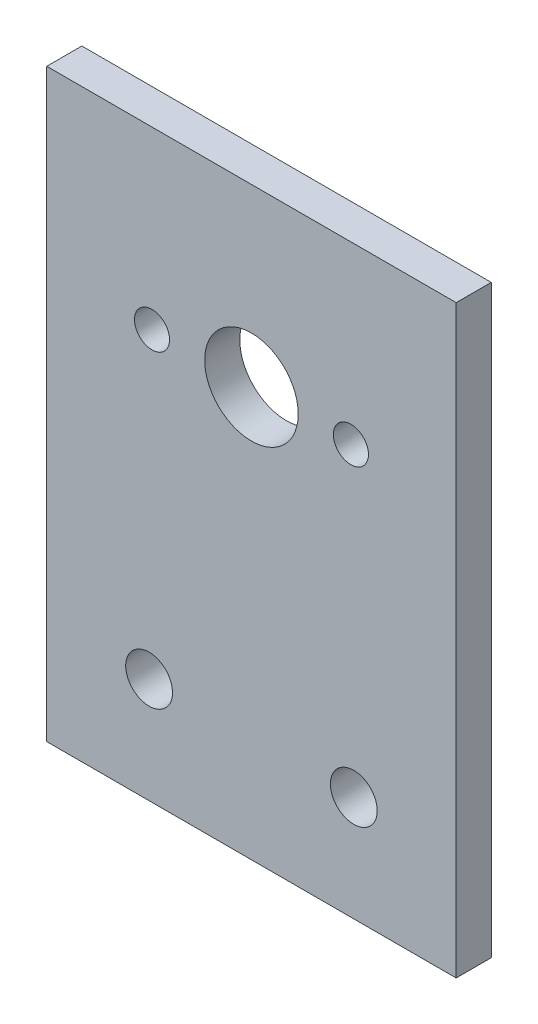
ISO-10303-21;
HEADER;
FILE_DESCRIPTION(('STEP AP214'),'2;1');
FILE_NAME('part.step','',(''),(''),'','','');
FILE_SCHEMA(('AUTOMOTIVE_DESIGN { 1 0 10303 214 1 1 1 1 }'));
ENDSEC;
DATA;
#1=APPLICATION_CONTEXT('core data for automotive mechanical design processes');
#2=APPLICATION_PROTOCOL_DEFINITION('international standard','automotive_design',2000,#1);
#3=PRODUCT_CONTEXT('',#1,'mechanical');
#4=PRODUCT('Part','Part','',(#3));
#5=PRODUCT_RELATED_PRODUCT_CATEGORY('part','',(#4));
#6=PRODUCT_DEFINITION_FORMATION('','',#4);
#7=PRODUCT_DEFINITION_CONTEXT('part definition',#1,'design');
#8=PRODUCT_DEFINITION('design','',#6,#7);
#9=PRODUCT_DEFINITION_SHAPE('','',#8);
#10=(LENGTH_UNIT() NAMED_UNIT(*) SI_UNIT(.MILLI.,.METRE.));
#11=(NAMED_UNIT(*) PLANE_ANGLE_UNIT() SI_UNIT($,.RADIAN.));
#12=(NAMED_UNIT(*) SI_UNIT($,.STERADIAN.) SOLID_ANGLE_UNIT());
#13=UNCERTAINTY_MEASURE_WITH_UNIT(LENGTH_MEASURE(1.E-05),#10,'distance_accuracy_value','');
#14=(GEOMETRIC_REPRESENTATION_CONTEXT(3) GLOBAL_UNCERTAINTY_ASSIGNED_CONTEXT((#13)) GLOBAL_UNIT_ASSIGNED_CONTEXT((#10,
#11,#12)) REPRESENTATION_CONTEXT('',''));
#15=CARTESIAN_POINT('',(0.,0.,0.));
#16=DIRECTION('',(0.,0.,1.));
#17=DIRECTION('',(1.,0.,0.));
#18=AXIS2_PLACEMENT_3D('',#15,#16,#17);
#19=CARTESIAN_POINT('',(0.,0.,3.));
#20=DIRECTION('',(0.,0.,1.));
#21=DIRECTION('',(1.,0.,0.));
#22=AXIS2_PLACEMENT_3D('',#19,#20,#21);
#23=PLANE('',#22);
#24=CARTESIAN_POINT('',(8.5,10.,3.));
#25=DIRECTION('',(0.,0.,1.));
#26=DIRECTION('',(1.,0.,0.));
#27=AXIS2_PLACEMENT_3D('',#24,#25,#26);
#28=CIRCLE('',#27,1.5);
#29=CARTESIAN_POINT('',(10.,10.,3.));
#30=VERTEX_POINT('',#29);
#31=EDGE_CURVE('E127',#30,#30,#28,.T.);
#32=ORIENTED_EDGE('',*,*,#31,.F.);
#33=EDGE_LOOP('',(#32));
#34=FACE_BOUND('',#33,.T.);
#35=CARTESIAN_POINT('',(-8.75,-16.,3.));
#36=DIRECTION('',(0.,0.,1.));
#37=DIRECTION('',(1.,0.,0.));
#38=AXIS2_PLACEMENT_3D('',#35,#36,#37);
#39=CIRCLE('',#38,2.);
#40=CARTESIAN_POINT('',(-6.75,-16.,3.));
#41=VERTEX_POINT('',#40);
#42=EDGE_CURVE('E115',#41,#41,#39,.T.);
#43=ORIENTED_EDGE('',*,*,#42,.F.);
#44=EDGE_LOOP('',(#43));
#45=FACE_BOUND('',#44,.T.);
#46=DIRECTION('',(0.,1.,0.));
#47=VECTOR('',#46,1.);
#48=CARTESIAN_POINT('',(17.5,25.,3.));
#49=LINE('',#48,#47);
#50=CARTESIAN_POINT('',(17.5,-25.,3.));
#51=VERTEX_POINT('',#50);
#52=CARTESIAN_POINT('',(17.5,25.,3.));
#53=VERTEX_POINT('',#52);
#54=EDGE_CURVE('E85',#51,#53,#49,.T.);
#55=ORIENTED_EDGE('',*,*,#54,.T.);
#56=DIRECTION('',(-1.,0.,0.));
#57=VECTOR('',#56,1.);
#58=CARTESIAN_POINT('',(-17.5,25.,3.));
#59=LINE('',#58,#57);
#60=CARTESIAN_POINT('',(-17.5,25.,3.));
#61=VERTEX_POINT('',#60);
#62=EDGE_CURVE('E80',#53,#61,#59,.T.);
#63=ORIENTED_EDGE('',*,*,#62,.T.);
#64=DIRECTION('',(0.,-1.,0.));
#65=VECTOR('',#64,1.);
#66=CARTESIAN_POINT('',(-17.5,25.,3.));
#67=LINE('',#66,#65);
#68=CARTESIAN_POINT('',(-17.5,-25.,3.));
#69=VERTEX_POINT('',#68);
#70=EDGE_CURVE('E83',#61,#69,#67,.T.);
#71=ORIENTED_EDGE('',*,*,#70,.T.);
#72=DIRECTION('',(1.,0.,0.));
#73=VECTOR('',#72,1.);
#74=CARTESIAN_POINT('',(-17.5,-25.,3.));
#75=LINE('',#74,#73);
#76=EDGE_CURVE('E50',#69,#51,#75,.T.);
#77=ORIENTED_EDGE('',*,*,#76,.T.);
#78=EDGE_LOOP('',(#55,#63,#71,#77));
#79=FACE_BOUND('',#78,.T.);
#80=CARTESIAN_POINT('',(8.75,-16.,3.));
#81=DIRECTION('',(0.,0.,1.));
#82=DIRECTION('',(1.,0.,0.));
#83=AXIS2_PLACEMENT_3D('',#80,#81,#82);
#84=CIRCLE('',#83,2.);
#85=CARTESIAN_POINT('',(10.75,-16.,3.));
#86=VERTEX_POINT('',#85);
#87=EDGE_CURVE('E100',#86,#86,#84,.T.);
#88=ORIENTED_EDGE('',*,*,#87,.F.);
#89=EDGE_LOOP('',(#88));
#90=FACE_BOUND('',#89,.T.);
#91=CARTESIAN_POINT('',(0.,10.,3.));
#92=DIRECTION('',(0.,0.,1.));
#93=DIRECTION('',(1.,0.,0.));
#94=AXIS2_PLACEMENT_3D('',#91,#92,#93);
#95=CIRCLE('',#94,4.);
#96=CARTESIAN_POINT('',(4.,10.,3.));
#97=VERTEX_POINT('',#96);
#98=EDGE_CURVE('E121',#97,#97,#95,.T.);
#99=ORIENTED_EDGE('',*,*,#98,.F.);
#100=EDGE_LOOP('',(#99));
#101=FACE_BOUND('',#100,.T.);
#102=CARTESIAN_POINT('',(-8.5,10.,3.));
#103=DIRECTION('',(0.,0.,1.));
#104=DIRECTION('',(1.,0.,0.));
#105=AXIS2_PLACEMENT_3D('',#102,#103,#104);
#106=CIRCLE('',#105,1.5);
#107=CARTESIAN_POINT('',(-7.,10.,3.));
#108=VERTEX_POINT('',#107);
#109=EDGE_CURVE('E133',#108,#108,#106,.T.);
#110=ORIENTED_EDGE('',*,*,#109,.F.);
#111=EDGE_LOOP('',(#110));
#112=FACE_BOUND('',#111,.T.);
#113=ADVANCED_FACE('F33',(#34,#45,#79,#90,#101,#112),#23,.T.);
#114=CARTESIAN_POINT('',(0.,0.,0.));
#115=DIRECTION('',(0.,0.,1.));
#116=DIRECTION('',(1.,0.,0.));
#117=AXIS2_PLACEMENT_3D('',#114,#115,#116);
#118=PLANE('',#117);
#119=CARTESIAN_POINT('',(8.5,10.,0.));
#120=DIRECTION('',(0.,0.,1.));
#121=DIRECTION('',(1.,0.,0.));
#122=AXIS2_PLACEMENT_3D('',#119,#120,#121);
#123=CIRCLE('',#122,1.5);
#124=CARTESIAN_POINT('',(10.,10.,0.));
#125=VERTEX_POINT('',#124);
#126=EDGE_CURVE('E130',#125,#125,#123,.T.);
#127=ORIENTED_EDGE('',*,*,#126,.T.);
#128=EDGE_LOOP('',(#127));
#129=FACE_BOUND('',#128,.T.);
#130=CARTESIAN_POINT('',(-8.75,-16.,0.));
#131=DIRECTION('',(0.,0.,1.));
#132=DIRECTION('',(1.,0.,0.));
#133=AXIS2_PLACEMENT_3D('',#130,#131,#132);
#134=CIRCLE('',#133,2.);
#135=CARTESIAN_POINT('',(-6.75,-16.,0.));
#136=VERTEX_POINT('',#135);
#137=EDGE_CURVE('E118',#136,#136,#134,.T.);
#138=ORIENTED_EDGE('',*,*,#137,.T.);
#139=EDGE_LOOP('',(#138));
#140=FACE_BOUND('',#139,.T.);
#141=DIRECTION('',(0.,1.,0.));
#142=VECTOR('',#141,1.);
#143=CARTESIAN_POINT('',(17.5,25.,0.));
#144=LINE('',#143,#142);
#145=CARTESIAN_POINT('',(17.5,-25.,0.));
#146=VERTEX_POINT('',#145);
#147=CARTESIAN_POINT('',(17.5,25.,0.));
#148=VERTEX_POINT('',#147);
#149=EDGE_CURVE('E97',#146,#148,#144,.T.);
#150=ORIENTED_EDGE('',*,*,#149,.F.);
#151=DIRECTION('',(1.,0.,0.));
#152=VECTOR('',#151,1.);
#153=CARTESIAN_POINT('',(-17.5,-25.,0.));
#154=LINE('',#153,#152);
#155=CARTESIAN_POINT('',(-17.5,-25.,0.));
#156=VERTEX_POINT('',#155);
#157=EDGE_CURVE('E73',#156,#146,#154,.T.);
#158=ORIENTED_EDGE('',*,*,#157,.F.);
#159=DIRECTION('',(0.,-1.,0.));
#160=VECTOR('',#159,1.);
#161=CARTESIAN_POINT('',(-17.5,25.,0.));
#162=LINE('',#161,#160);
#163=CARTESIAN_POINT('',(-17.5,25.,0.));
#164=VERTEX_POINT('',#163);
#165=EDGE_CURVE('E67',#164,#156,#162,.T.);
#166=ORIENTED_EDGE('',*,*,#165,.F.);
#167=DIRECTION('',(-1.,0.,0.));
#168=VECTOR('',#167,1.);
#169=CARTESIAN_POINT('',(-17.5,25.,0.));
#170=LINE('',#169,#168);
#171=EDGE_CURVE('E89',#148,#164,#170,.T.);
#172=ORIENTED_EDGE('',*,*,#171,.F.);
#173=EDGE_LOOP('',(#150,#158,#166,#172));
#174=FACE_BOUND('',#173,.T.);
#175=CARTESIAN_POINT('',(8.75,-16.,0.));
#176=DIRECTION('',(0.,0.,1.));
#177=DIRECTION('',(1.,0.,0.));
#178=AXIS2_PLACEMENT_3D('',#175,#176,#177);
#179=CIRCLE('',#178,2.);
#180=CARTESIAN_POINT('',(10.75,-16.,0.));
#181=VERTEX_POINT('',#180);
#182=EDGE_CURVE('E112',#181,#181,#179,.T.);
#183=ORIENTED_EDGE('',*,*,#182,.T.);
#184=EDGE_LOOP('',(#183));
#185=FACE_BOUND('',#184,.T.);
#186=CARTESIAN_POINT('',(0.,10.,0.));
#187=DIRECTION('',(0.,0.,1.));
#188=DIRECTION('',(1.,0.,0.));
#189=AXIS2_PLACEMENT_3D('',#186,#187,#188);
#190=CIRCLE('',#189,4.);
#191=CARTESIAN_POINT('',(4.,10.,0.));
#192=VERTEX_POINT('',#191);
#193=EDGE_CURVE('E124',#192,#192,#190,.T.);
#194=ORIENTED_EDGE('',*,*,#193,.T.);
#195=EDGE_LOOP('',(#194));
#196=FACE_BOUND('',#195,.T.);
#197=CARTESIAN_POINT('',(-8.5,10.,0.));
#198=DIRECTION('',(0.,0.,1.));
#199=DIRECTION('',(1.,0.,0.));
#200=AXIS2_PLACEMENT_3D('',#197,#198,#199);
#201=CIRCLE('',#200,1.5);
#202=CARTESIAN_POINT('',(-7.,10.,0.));
#203=VERTEX_POINT('',#202);
#204=EDGE_CURVE('E136',#203,#203,#201,.T.);
#205=ORIENTED_EDGE('',*,*,#204,.T.);
#206=EDGE_LOOP('',(#205));
#207=FACE_BOUND('',#206,.T.);
#208=ADVANCED_FACE('F108',(#129,#140,#174,#185,#196,#207),#118,.F.);
#209=CARTESIAN_POINT('',(17.5,25.,3.));
#210=DIRECTION('',(-1.,0.,0.));
#211=DIRECTION('',(0.,-1.,0.));
#212=AXIS2_PLACEMENT_3D('',#209,#210,#211);
#213=PLANE('',#212);
#214=ORIENTED_EDGE('',*,*,#149,.T.);
#215=DIRECTION('',(0.,0.,-1.));
#216=VECTOR('',#215,1.);
#217=CARTESIAN_POINT('',(17.5,25.,3.));
#218=LINE('',#217,#216);
#219=EDGE_CURVE('E11',#53,#148,#218,.T.);
#220=ORIENTED_EDGE('',*,*,#219,.F.);
#221=ORIENTED_EDGE('',*,*,#54,.F.);
#222=DIRECTION('',(0.,0.,-1.));
#223=VECTOR('',#222,1.);
#224=CARTESIAN_POINT('',(17.5,-25.,3.));
#225=LINE('',#224,#223);
#226=EDGE_CURVE('E93',#51,#146,#225,.T.);
#227=ORIENTED_EDGE('',*,*,#226,.T.);
#228=EDGE_LOOP('',(#214,#220,#221,#227));
#229=FACE_BOUND('',#228,.T.);
#230=ADVANCED_FACE('F35',(#229),#213,.F.);
#231=CARTESIAN_POINT('',(-17.5,25.,3.));
#232=DIRECTION('',(0.,-1.,0.));
#233=DIRECTION('',(0.,0.,-1.));
#234=AXIS2_PLACEMENT_3D('',#231,#232,#233);
#235=PLANE('',#234);
#236=ORIENTED_EDGE('',*,*,#171,.T.);
#237=DIRECTION('',(0.,0.,-1.));
#238=VECTOR('',#237,1.);
#239=CARTESIAN_POINT('',(-17.5,25.,3.));
#240=LINE('',#239,#238);
#241=EDGE_CURVE('E42',#61,#164,#240,.T.);
#242=ORIENTED_EDGE('',*,*,#241,.F.);
#243=ORIENTED_EDGE('',*,*,#62,.F.);
#244=ORIENTED_EDGE('',*,*,#219,.T.);
#245=EDGE_LOOP('',(#236,#242,#243,#244));
#246=FACE_BOUND('',#245,.T.);
#247=ADVANCED_FACE('F88',(#246),#235,.F.);
#248=CARTESIAN_POINT('',(-17.5,25.,3.));
#249=DIRECTION('',(1.,0.,0.));
#250=DIRECTION('',(0.,1.,0.));
#251=AXIS2_PLACEMENT_3D('',#248,#249,#250);
#252=PLANE('',#251);
#253=ORIENTED_EDGE('',*,*,#165,.T.);
#254=DIRECTION('',(0.,0.,-1.));
#255=VECTOR('',#254,1.);
#256=CARTESIAN_POINT('',(-17.5,-25.,3.));
#257=LINE('',#256,#255);
#258=EDGE_CURVE('E90',#69,#156,#257,.T.);
#259=ORIENTED_EDGE('',*,*,#258,.F.);
#260=ORIENTED_EDGE('',*,*,#70,.F.);
#261=ORIENTED_EDGE('',*,*,#241,.T.);
#262=EDGE_LOOP('',(#253,#259,#260,#261));
#263=FACE_BOUND('',#262,.T.);
#264=ADVANCED_FACE('F91',(#263),#252,.F.);
#265=CARTESIAN_POINT('',(-17.5,-25.,3.));
#266=DIRECTION('',(0.,1.,0.));
#267=DIRECTION('',(0.,0.,1.));
#268=AXIS2_PLACEMENT_3D('',#265,#266,#267);
#269=PLANE('',#268);
#270=ORIENTED_EDGE('',*,*,#157,.T.);
#271=ORIENTED_EDGE('',*,*,#226,.F.);
#272=ORIENTED_EDGE('',*,*,#76,.F.);
#273=ORIENTED_EDGE('',*,*,#258,.T.);
#274=EDGE_LOOP('',(#270,#271,#272,#273));
#275=FACE_BOUND('',#274,.T.);
#276=ADVANCED_FACE('F105',(#275),#269,.F.);
#277=CARTESIAN_POINT('',(8.75,-16.,3.));
#278=DIRECTION('',(0.,0.,-1.));
#279=DIRECTION('',(-1.,0.,0.));
#280=AXIS2_PLACEMENT_3D('',#277,#278,#279);
#281=CYLINDRICAL_SURFACE('',#280,2.);
#282=ORIENTED_EDGE('',*,*,#87,.T.);
#283=EDGE_LOOP('',(#282));
#284=FACE_BOUND('',#283,.T.);
#285=ORIENTED_EDGE('',*,*,#182,.F.);
#286=EDGE_LOOP('',(#285));
#287=FACE_BOUND('',#286,.T.);
#288=ADVANCED_FACE('F156',(#284,#287),#281,.F.);
#289=CARTESIAN_POINT('',(-8.75,-16.,3.));
#290=DIRECTION('',(0.,0.,-1.));
#291=DIRECTION('',(-1.,0.,0.));
#292=AXIS2_PLACEMENT_3D('',#289,#290,#291);
#293=CYLINDRICAL_SURFACE('',#292,2.);
#294=ORIENTED_EDGE('',*,*,#42,.T.);
#295=EDGE_LOOP('',(#294));
#296=FACE_BOUND('',#295,.T.);
#297=ORIENTED_EDGE('',*,*,#137,.F.);
#298=EDGE_LOOP('',(#297));
#299=FACE_BOUND('',#298,.T.);
#300=ADVANCED_FACE('F202',(#296,#299),#293,.F.);
#301=CARTESIAN_POINT('',(0.,10.,3.));
#302=DIRECTION('',(0.,0.,-1.));
#303=DIRECTION('',(-1.,0.,0.));
#304=AXIS2_PLACEMENT_3D('',#301,#302,#303);
#305=CYLINDRICAL_SURFACE('',#304,4.);
#306=ORIENTED_EDGE('',*,*,#98,.T.);
#307=EDGE_LOOP('',(#306));
#308=FACE_BOUND('',#307,.T.);
#309=ORIENTED_EDGE('',*,*,#193,.F.);
#310=EDGE_LOOP('',(#309));
#311=FACE_BOUND('',#310,.T.);
#312=ADVANCED_FACE('F210',(#308,#311),#305,.F.);
#313=CARTESIAN_POINT('',(8.5,10.,3.));
#314=DIRECTION('',(0.,0.,-1.));
#315=DIRECTION('',(-1.,0.,0.));
#316=AXIS2_PLACEMENT_3D('',#313,#314,#315);
#317=CYLINDRICAL_SURFACE('',#316,1.5);
#318=ORIENTED_EDGE('',*,*,#31,.T.);
#319=EDGE_LOOP('',(#318));
#320=FACE_BOUND('',#319,.T.);
#321=ORIENTED_EDGE('',*,*,#126,.F.);
#322=EDGE_LOOP('',(#321));
#323=FACE_BOUND('',#322,.T.);
#324=ADVANCED_FACE('F218',(#320,#323),#317,.F.);
#325=CARTESIAN_POINT('',(-8.5,10.,3.));
#326=DIRECTION('',(0.,0.,-1.));
#327=DIRECTION('',(-1.,0.,0.));
#328=AXIS2_PLACEMENT_3D('',#325,#326,#327);
#329=CYLINDRICAL_SURFACE('',#328,1.5);
#330=ORIENTED_EDGE('',*,*,#109,.T.);
#331=EDGE_LOOP('',(#330));
#332=FACE_BOUND('',#331,.T.);
#333=ORIENTED_EDGE('',*,*,#204,.F.);
#334=EDGE_LOOP('',(#333));
#335=FACE_BOUND('',#334,.T.);
#336=ADVANCED_FACE('F142',(#332,#335),#329,.F.);
#337=CLOSED_SHELL('',(#113,#208,#230,#247,#264,#276,#288,#300,#312,#324,#336));
#338=MANIFOLD_SOLID_BREP('B2',#337);
#339=ADVANCED_BREP_SHAPE_REPRESENTATION('',(#18,#338),#14);
#340=SHAPE_DEFINITION_REPRESENTATION(#9,#339);
ENDSEC;
END-ISO-10303-21;
